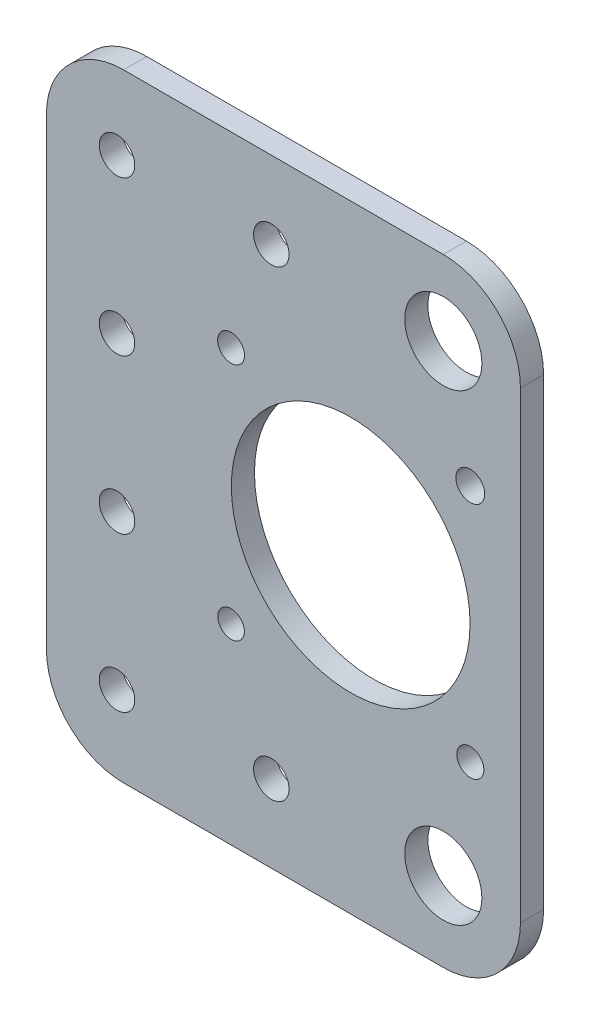
ISO-10303-21;
HEADER;
FILE_DESCRIPTION(('STEP AP214'),'2;1');
FILE_NAME('part.step','',(''),(''),'','','');
FILE_SCHEMA(('AUTOMOTIVE_DESIGN { 1 0 10303 214 1 1 1 1 }'));
ENDSEC;
DATA;
#1=APPLICATION_CONTEXT('core data for automotive mechanical design processes');
#2=APPLICATION_PROTOCOL_DEFINITION('international standard','automotive_design',2000,#1);
#3=PRODUCT_CONTEXT('',#1,'mechanical');
#4=PRODUCT('Part','Part','',(#3));
#5=PRODUCT_RELATED_PRODUCT_CATEGORY('part','',(#4));
#6=PRODUCT_DEFINITION_FORMATION('','',#4);
#7=PRODUCT_DEFINITION_CONTEXT('part definition',#1,'design');
#8=PRODUCT_DEFINITION('design','',#6,#7);
#9=PRODUCT_DEFINITION_SHAPE('','',#8);
#10=(LENGTH_UNIT() NAMED_UNIT(*) SI_UNIT(.MILLI.,.METRE.));
#11=(NAMED_UNIT(*) PLANE_ANGLE_UNIT() SI_UNIT($,.RADIAN.));
#12=(NAMED_UNIT(*) SI_UNIT($,.STERADIAN.) SOLID_ANGLE_UNIT());
#13=UNCERTAINTY_MEASURE_WITH_UNIT(LENGTH_MEASURE(1.E-05),#10,'distance_accuracy_value','');
#14=(GEOMETRIC_REPRESENTATION_CONTEXT(3) GLOBAL_UNCERTAINTY_ASSIGNED_CONTEXT((#13)) GLOBAL_UNIT_ASSIGNED_CONTEXT((#10,
#11,#12)) REPRESENTATION_CONTEXT('',''));
#15=CARTESIAN_POINT('',(0.,0.,0.));
#16=DIRECTION('',(0.,0.,1.));
#17=DIRECTION('',(1.,0.,0.));
#18=AXIS2_PLACEMENT_3D('',#15,#16,#17);
#19=CARTESIAN_POINT('',(157.960700719284,-141.896756478859,3.));
#20=DIRECTION('',(0.,0.,1.));
#21=DIRECTION('',(1.,0.,0.));
#22=AXIS2_PLACEMENT_3D('',#19,#20,#21);
#23=PLANE('',#22);
#24=CARTESIAN_POINT('',(157.960700719284,-141.591712302338,3.));
#25=DIRECTION('',(0.,0.,1.));
#26=DIRECTION('',(1.,0.,0.));
#27=AXIS2_PLACEMENT_3D('',#24,#25,#26);
#28=CIRCLE('',#27,4.99999999999999);
#29=CARTESIAN_POINT('',(162.960700719284,-141.591712302338,3.));
#30=VERTEX_POINT('',#29);
#31=EDGE_CURVE('E242',#30,#30,#28,.T.);
#32=ORIENTED_EDGE('',*,*,#31,.F.);
#33=EDGE_LOOP('',(#32));
#34=FACE_BOUND('',#33,.T.);
#35=CARTESIAN_POINT('',(161.460700719284,-127.091712302338,3.));
#36=DIRECTION('',(0.,0.,1.));
#37=DIRECTION('',(1.,0.,0.));
#38=AXIS2_PLACEMENT_3D('',#35,#36,#37);
#39=CIRCLE('',#38,1.75420597389953);
#40=CARTESIAN_POINT('',(163.214906693183,-127.091712302338,3.));
#41=VERTEX_POINT('',#40);
#42=EDGE_CURVE('E230',#41,#41,#39,.T.);
#43=ORIENTED_EDGE('',*,*,#42,.F.);
#44=EDGE_LOOP('',(#43));
#45=FACE_BOUND('',#44,.T.);
#46=CARTESIAN_POINT('',(161.460700719284,-96.0917123023381,3.));
#47=DIRECTION('',(0.,0.,1.));
#48=DIRECTION('',(1.,0.,0.));
#49=AXIS2_PLACEMENT_3D('',#46,#47,#48);
#50=CIRCLE('',#49,1.87320006257759);
#51=CARTESIAN_POINT('',(163.333900781861,-96.0917123023381,3.));
#52=VERTEX_POINT('',#51);
#53=EDGE_CURVE('E218',#52,#52,#50,.T.);
#54=ORIENTED_EDGE('',*,*,#53,.F.);
#55=EDGE_LOOP('',(#54));
#56=FACE_BOUND('',#55,.T.);
#57=CARTESIAN_POINT('',(115.674612815836,-141.866196007986,3.));
#58=DIRECTION('',(0.,0.,1.));
#59=DIRECTION('',(1.,0.,0.));
#60=AXIS2_PLACEMENT_3D('',#57,#58,#59);
#61=CIRCLE('',#60,2.30000000000001);
#62=CARTESIAN_POINT('',(117.974612815836,-141.866196007986,3.));
#63=VERTEX_POINT('',#62);
#64=EDGE_CURVE('E206',#63,#63,#61,.T.);
#65=ORIENTED_EDGE('',*,*,#64,.F.);
#66=EDGE_LOOP('',(#65));
#67=FACE_BOUND('',#66,.T.);
#68=CARTESIAN_POINT('',(135.674612815836,-81.8661960079857,3.));
#69=DIRECTION('',(0.,0.,1.));
#70=DIRECTION('',(1.,0.,0.));
#71=AXIS2_PLACEMENT_3D('',#68,#69,#70);
#72=CIRCLE('',#71,2.30000000000001);
#73=CARTESIAN_POINT('',(137.974612815836,-81.8661960079857,3.));
#74=VERTEX_POINT('',#73);
#75=EDGE_CURVE('E194',#74,#74,#72,.T.);
#76=ORIENTED_EDGE('',*,*,#75,.F.);
#77=EDGE_LOOP('',(#76));
#78=FACE_BOUND('',#77,.T.);
#79=CARTESIAN_POINT('',(115.674612815836,-121.866196007986,3.));
#80=DIRECTION('',(0.,0.,1.));
#81=DIRECTION('',(1.,0.,0.));
#82=AXIS2_PLACEMENT_3D('',#79,#80,#81);
#83=CIRCLE('',#82,2.30000000000001);
#84=CARTESIAN_POINT('',(117.974612815836,-121.866196007986,3.));
#85=VERTEX_POINT('',#84);
#86=EDGE_CURVE('E182',#85,#85,#83,.T.);
#87=ORIENTED_EDGE('',*,*,#86,.F.);
#88=EDGE_LOOP('',(#87));
#89=FACE_BOUND('',#88,.T.);
#90=CARTESIAN_POINT('',(157.960700719284,-141.896756478859,3.));
#91=DIRECTION('',(0.,0.,1.));
#92=DIRECTION('',(1.,0.,0.));
#93=AXIS2_PLACEMENT_3D('',#90,#91,#92);
#94=CIRCLE('',#93,9.99999999999999);
#95=CARTESIAN_POINT('',(157.960700719284,-151.896756478859,3.));
#96=VERTEX_POINT('',#95);
#97=CARTESIAN_POINT('',(167.960700719284,-141.896756478859,3.));
#98=VERTEX_POINT('',#97);
#99=EDGE_CURVE('E145',#96,#98,#94,.T.);
#100=ORIENTED_EDGE('',*,*,#99,.T.);
#101=DIRECTION('',(0.,1.,0.));
#102=VECTOR('',#101,1.);
#103=CARTESIAN_POINT('',(167.960700719284,-81.8661960079857,3.));
#104=LINE('',#103,#102);
#105=CARTESIAN_POINT('',(167.960700719284,-81.8661960079857,3.));
#106=VERTEX_POINT('',#105);
#107=EDGE_CURVE('E93',#98,#106,#104,.T.);
#108=ORIENTED_EDGE('',*,*,#107,.T.);
#109=CARTESIAN_POINT('',(157.960700719284,-81.8661960079857,3.));
#110=DIRECTION('',(0.,0.,1.));
#111=DIRECTION('',(-1.,0.,0.));
#112=AXIS2_PLACEMENT_3D('',#109,#110,#111);
#113=CIRCLE('',#112,10.);
#114=CARTESIAN_POINT('',(157.960700719284,-71.8661960079857,3.));
#115=VERTEX_POINT('',#114);
#116=EDGE_CURVE('E160',#106,#115,#113,.T.);
#117=ORIENTED_EDGE('',*,*,#116,.T.);
#118=DIRECTION('',(-1.,0.,0.));
#119=VECTOR('',#118,1.);
#120=CARTESIAN_POINT('',(116.52582366594,-71.8661960079857,3.));
#121=LINE('',#120,#119);
#122=CARTESIAN_POINT('',(116.52582366594,-71.8661960079857,3.));
#123=VERTEX_POINT('',#122);
#124=EDGE_CURVE('E173',#115,#123,#121,.T.);
#125=ORIENTED_EDGE('',*,*,#124,.T.);
#126=CARTESIAN_POINT('',(116.52582366594,-81.8661960079857,3.));
#127=DIRECTION('',(0.,0.,1.));
#128=DIRECTION('',(1.,0.,0.));
#129=AXIS2_PLACEMENT_3D('',#126,#127,#128);
#130=CIRCLE('',#129,9.99999999999999);
#131=CARTESIAN_POINT('',(106.52582366594,-81.8661960079857,3.));
#132=VERTEX_POINT('',#131);
#133=EDGE_CURVE('E112',#123,#132,#130,.T.);
#134=ORIENTED_EDGE('',*,*,#133,.T.);
#135=DIRECTION('',(0.,-1.,0.));
#136=VECTOR('',#135,1.);
#137=CARTESIAN_POINT('',(106.52582366594,-81.8661960079857,3.));
#138=LINE('',#137,#136);
#139=CARTESIAN_POINT('',(106.52582366594,-141.896756478859,3.));
#140=VERTEX_POINT('',#139);
#141=EDGE_CURVE('E106',#132,#140,#138,.T.);
#142=ORIENTED_EDGE('',*,*,#141,.T.);
#143=CARTESIAN_POINT('',(116.52582366594,-141.896756478859,3.));
#144=DIRECTION('',(0.,0.,1.));
#145=DIRECTION('',(1.,0.,0.));
#146=AXIS2_PLACEMENT_3D('',#143,#144,#145);
#147=CIRCLE('',#146,9.99999999999999);
#148=CARTESIAN_POINT('',(116.52582366594,-151.896756478859,3.));
#149=VERTEX_POINT('',#148);
#150=EDGE_CURVE('E110',#140,#149,#147,.T.);
#151=ORIENTED_EDGE('',*,*,#150,.T.);
#152=DIRECTION('',(1.,0.,0.));
#153=VECTOR('',#152,1.);
#154=CARTESIAN_POINT('',(116.52582366594,-151.896756478859,3.));
#155=LINE('',#154,#153);
#156=EDGE_CURVE('E50',#149,#96,#155,.T.);
#157=ORIENTED_EDGE('',*,*,#156,.T.);
#158=EDGE_LOOP('',(#100,#108,#117,#125,#134,#142,#151,#157));
#159=FACE_BOUND('',#158,.T.);
#160=CARTESIAN_POINT('',(115.674612815836,-101.866196007986,3.));
#161=DIRECTION('',(0.,0.,1.));
#162=DIRECTION('',(1.,0.,0.));
#163=AXIS2_PLACEMENT_3D('',#160,#161,#162);
#164=CIRCLE('',#163,2.29999999999999);
#165=CARTESIAN_POINT('',(117.974612815836,-101.866196007986,3.));
#166=VERTEX_POINT('',#165);
#167=EDGE_CURVE('E134',#166,#166,#164,.T.);
#168=ORIENTED_EDGE('',*,*,#167,.F.);
#169=EDGE_LOOP('',(#168));
#170=FACE_BOUND('',#169,.T.);
#171=CARTESIAN_POINT('',(135.674612815836,-141.866196007986,3.));
#172=DIRECTION('',(0.,0.,1.));
#173=DIRECTION('',(1.,0.,0.));
#174=AXIS2_PLACEMENT_3D('',#171,#172,#173);
#175=CIRCLE('',#174,2.30000000000001);
#176=CARTESIAN_POINT('',(137.974612815836,-141.866196007986,3.));
#177=VERTEX_POINT('',#176);
#178=EDGE_CURVE('E188',#177,#177,#175,.T.);
#179=ORIENTED_EDGE('',*,*,#178,.F.);
#180=EDGE_LOOP('',(#179));
#181=FACE_BOUND('',#180,.T.);
#182=CARTESIAN_POINT('',(115.674612815836,-81.8661960079857,3.));
#183=DIRECTION('',(0.,0.,1.));
#184=DIRECTION('',(1.,0.,0.));
#185=AXIS2_PLACEMENT_3D('',#182,#183,#184);
#186=CIRCLE('',#185,2.29999999999999);
#187=CARTESIAN_POINT('',(117.974612815836,-81.8661960079857,3.));
#188=VERTEX_POINT('',#187);
#189=EDGE_CURVE('E200',#188,#188,#186,.T.);
#190=ORIENTED_EDGE('',*,*,#189,.F.);
#191=EDGE_LOOP('',(#190));
#192=FACE_BOUND('',#191,.T.);
#193=CARTESIAN_POINT('',(130.460700719284,-96.0917123023381,3.));
#194=DIRECTION('',(0.,0.,1.));
#195=DIRECTION('',(1.,0.,0.));
#196=AXIS2_PLACEMENT_3D('',#193,#194,#195);
#197=CIRCLE('',#196,1.73788566181092);
#198=CARTESIAN_POINT('',(132.198586381095,-96.0917123023381,3.));
#199=VERTEX_POINT('',#198);
#200=EDGE_CURVE('E212',#199,#199,#197,.T.);
#201=ORIENTED_EDGE('',*,*,#200,.F.);
#202=EDGE_LOOP('',(#201));
#203=FACE_BOUND('',#202,.T.);
#204=CARTESIAN_POINT('',(130.460700719284,-127.091712302338,3.));
#205=DIRECTION('',(0.,0.,1.));
#206=DIRECTION('',(1.,0.,0.));
#207=AXIS2_PLACEMENT_3D('',#204,#205,#206);
#208=CIRCLE('',#207,1.72227871828202);
#209=CARTESIAN_POINT('',(132.182979437566,-127.091712302338,3.));
#210=VERTEX_POINT('',#209);
#211=EDGE_CURVE('E224',#210,#210,#208,.T.);
#212=ORIENTED_EDGE('',*,*,#211,.F.);
#213=EDGE_LOOP('',(#212));
#214=FACE_BOUND('',#213,.T.);
#215=CARTESIAN_POINT('',(145.960700719284,-111.591712302338,3.));
#216=DIRECTION('',(0.,0.,1.));
#217=DIRECTION('',(1.,0.,0.));
#218=AXIS2_PLACEMENT_3D('',#215,#216,#217);
#219=CIRCLE('',#218,15.469551166184);
#220=CARTESIAN_POINT('',(161.430251885468,-111.591712302338,3.));
#221=VERTEX_POINT('',#220);
#222=EDGE_CURVE('E236',#221,#221,#219,.T.);
#223=ORIENTED_EDGE('',*,*,#222,.F.);
#224=EDGE_LOOP('',(#223));
#225=FACE_BOUND('',#224,.T.);
#226=CARTESIAN_POINT('',(157.960700719284,-81.5917123023381,3.));
#227=DIRECTION('',(0.,0.,1.));
#228=DIRECTION('',(1.,0.,0.));
#229=AXIS2_PLACEMENT_3D('',#226,#227,#228);
#230=CIRCLE('',#229,5.00000000000002);
#231=CARTESIAN_POINT('',(162.960700719284,-81.5917123023381,3.));
#232=VERTEX_POINT('',#231);
#233=EDGE_CURVE('E248',#232,#232,#230,.T.);
#234=ORIENTED_EDGE('',*,*,#233,.F.);
#235=EDGE_LOOP('',(#234));
#236=FACE_BOUND('',#235,.T.);
#237=ADVANCED_FACE('F33',(#34,#45,#56,#67,#78,#89,#159,#170,#181,#192,#203,#214,#225,#236),#23,.T.);
#238=CARTESIAN_POINT('',(157.960700719284,-141.896756478859,0.));
#239=DIRECTION('',(0.,0.,1.));
#240=DIRECTION('',(1.,0.,0.));
#241=AXIS2_PLACEMENT_3D('',#238,#239,#240);
#242=PLANE('',#241);
#243=CARTESIAN_POINT('',(157.960700719284,-141.896756478859,0.));
#244=DIRECTION('',(0.,0.,1.));
#245=DIRECTION('',(1.,0.,0.));
#246=AXIS2_PLACEMENT_3D('',#243,#244,#245);
#247=CIRCLE('',#246,9.99999999999999);
#248=CARTESIAN_POINT('',(157.960700719284,-151.896756478859,0.));
#249=VERTEX_POINT('',#248);
#250=CARTESIAN_POINT('',(167.960700719284,-141.896756478859,0.));
#251=VERTEX_POINT('',#250);
#252=EDGE_CURVE('E130',#249,#251,#247,.T.);
#253=ORIENTED_EDGE('',*,*,#252,.F.);
#254=DIRECTION('',(1.,0.,0.));
#255=VECTOR('',#254,1.);
#256=CARTESIAN_POINT('',(116.52582366594,-151.896756478859,0.));
#257=LINE('',#256,#255);
#258=CARTESIAN_POINT('',(116.52582366594,-151.896756478859,0.));
#259=VERTEX_POINT('',#258);
#260=EDGE_CURVE('E85',#259,#249,#257,.T.);
#261=ORIENTED_EDGE('',*,*,#260,.F.);
#262=CARTESIAN_POINT('',(116.52582366594,-141.896756478859,0.));
#263=DIRECTION('',(0.,0.,1.));
#264=DIRECTION('',(1.,0.,0.));
#265=AXIS2_PLACEMENT_3D('',#262,#263,#264);
#266=CIRCLE('',#265,9.99999999999999);
#267=CARTESIAN_POINT('',(106.52582366594,-141.896756478859,0.));
#268=VERTEX_POINT('',#267);
#269=EDGE_CURVE('E79',#268,#259,#266,.T.);
#270=ORIENTED_EDGE('',*,*,#269,.F.);
#271=DIRECTION('',(0.,-1.,0.));
#272=VECTOR('',#271,1.);
#273=CARTESIAN_POINT('',(106.52582366594,-81.8661960079857,0.));
#274=LINE('',#273,#272);
#275=CARTESIAN_POINT('',(106.52582366594,-81.8661960079857,0.));
#276=VERTEX_POINT('',#275);
#277=EDGE_CURVE('E120',#276,#268,#274,.T.);
#278=ORIENTED_EDGE('',*,*,#277,.F.);
#279=CARTESIAN_POINT('',(116.52582366594,-81.8661960079857,0.));
#280=DIRECTION('',(0.,0.,1.));
#281=DIRECTION('',(1.,0.,0.));
#282=AXIS2_PLACEMENT_3D('',#279,#280,#281);
#283=CIRCLE('',#282,9.99999999999999);
#284=CARTESIAN_POINT('',(116.52582366594,-71.8661960079857,0.));
#285=VERTEX_POINT('',#284);
#286=EDGE_CURVE('E140',#285,#276,#283,.T.);
#287=ORIENTED_EDGE('',*,*,#286,.F.);
#288=DIRECTION('',(-1.,0.,0.));
#289=VECTOR('',#288,1.);
#290=CARTESIAN_POINT('',(116.52582366594,-71.8661960079857,0.));
#291=LINE('',#290,#289);
#292=CARTESIAN_POINT('',(157.960700719284,-71.8661960079857,0.));
#293=VERTEX_POINT('',#292);
#294=EDGE_CURVE('E138',#293,#285,#291,.T.);
#295=ORIENTED_EDGE('',*,*,#294,.F.);
#296=CARTESIAN_POINT('',(157.960700719284,-81.8661960079857,0.));
#297=DIRECTION('',(0.,0.,1.));
#298=DIRECTION('',(-1.,0.,0.));
#299=AXIS2_PLACEMENT_3D('',#296,#297,#298);
#300=CIRCLE('',#299,10.);
#301=CARTESIAN_POINT('',(167.960700719284,-81.8661960079857,0.));
#302=VERTEX_POINT('',#301);
#303=EDGE_CURVE('E136',#302,#293,#300,.T.);
#304=ORIENTED_EDGE('',*,*,#303,.F.);
#305=DIRECTION('',(0.,1.,0.));
#306=VECTOR('',#305,1.);
#307=CARTESIAN_POINT('',(167.960700719284,-81.8661960079857,0.));
#308=LINE('',#307,#306);
#309=EDGE_CURVE('E133',#251,#302,#308,.T.);
#310=ORIENTED_EDGE('',*,*,#309,.F.);
#311=EDGE_LOOP('',(#253,#261,#270,#278,#287,#295,#304,#310));
#312=FACE_BOUND('',#311,.T.);
#313=CARTESIAN_POINT('',(115.674612815836,-101.866196007986,0.));
#314=DIRECTION('',(0.,0.,1.));
#315=DIRECTION('',(1.,0.,0.));
#316=AXIS2_PLACEMENT_3D('',#313,#314,#315);
#317=CIRCLE('',#316,2.29999999999999);
#318=CARTESIAN_POINT('',(117.974612815836,-101.866196007986,0.));
#319=VERTEX_POINT('',#318);
#320=EDGE_CURVE('E179',#319,#319,#317,.T.);
#321=ORIENTED_EDGE('',*,*,#320,.T.);
#322=EDGE_LOOP('',(#321));
#323=FACE_BOUND('',#322,.T.);
#324=CARTESIAN_POINT('',(115.674612815836,-121.866196007986,0.));
#325=DIRECTION('',(0.,0.,1.));
#326=DIRECTION('',(1.,0.,0.));
#327=AXIS2_PLACEMENT_3D('',#324,#325,#326);
#328=CIRCLE('',#327,2.30000000000001);
#329=CARTESIAN_POINT('',(117.974612815836,-121.866196007986,0.));
#330=VERTEX_POINT('',#329);
#331=EDGE_CURVE('E185',#330,#330,#328,.T.);
#332=ORIENTED_EDGE('',*,*,#331,.T.);
#333=EDGE_LOOP('',(#332));
#334=FACE_BOUND('',#333,.T.);
#335=CARTESIAN_POINT('',(135.674612815836,-141.866196007986,0.));
#336=DIRECTION('',(0.,0.,1.));
#337=DIRECTION('',(1.,0.,0.));
#338=AXIS2_PLACEMENT_3D('',#335,#336,#337);
#339=CIRCLE('',#338,2.30000000000001);
#340=CARTESIAN_POINT('',(137.974612815836,-141.866196007986,0.));
#341=VERTEX_POINT('',#340);
#342=EDGE_CURVE('E191',#341,#341,#339,.T.);
#343=ORIENTED_EDGE('',*,*,#342,.T.);
#344=EDGE_LOOP('',(#343));
#345=FACE_BOUND('',#344,.T.);
#346=CARTESIAN_POINT('',(135.674612815836,-81.8661960079857,0.));
#347=DIRECTION('',(0.,0.,1.));
#348=DIRECTION('',(1.,0.,0.));
#349=AXIS2_PLACEMENT_3D('',#346,#347,#348);
#350=CIRCLE('',#349,2.30000000000001);
#351=CARTESIAN_POINT('',(137.974612815836,-81.8661960079857,0.));
#352=VERTEX_POINT('',#351);
#353=EDGE_CURVE('E197',#352,#352,#350,.T.);
#354=ORIENTED_EDGE('',*,*,#353,.T.);
#355=EDGE_LOOP('',(#354));
#356=FACE_BOUND('',#355,.T.);
#357=CARTESIAN_POINT('',(115.674612815836,-81.8661960079857,0.));
#358=DIRECTION('',(0.,0.,1.));
#359=DIRECTION('',(1.,0.,0.));
#360=AXIS2_PLACEMENT_3D('',#357,#358,#359);
#361=CIRCLE('',#360,2.29999999999999);
#362=CARTESIAN_POINT('',(117.974612815836,-81.8661960079857,0.));
#363=VERTEX_POINT('',#362);
#364=EDGE_CURVE('E203',#363,#363,#361,.T.);
#365=ORIENTED_EDGE('',*,*,#364,.T.);
#366=EDGE_LOOP('',(#365));
#367=FACE_BOUND('',#366,.T.);
#368=CARTESIAN_POINT('',(115.674612815836,-141.866196007986,0.));
#369=DIRECTION('',(0.,0.,1.));
#370=DIRECTION('',(1.,0.,0.));
#371=AXIS2_PLACEMENT_3D('',#368,#369,#370);
#372=CIRCLE('',#371,2.30000000000001);
#373=CARTESIAN_POINT('',(117.974612815836,-141.866196007986,0.));
#374=VERTEX_POINT('',#373);
#375=EDGE_CURVE('E209',#374,#374,#372,.T.);
#376=ORIENTED_EDGE('',*,*,#375,.T.);
#377=EDGE_LOOP('',(#376));
#378=FACE_BOUND('',#377,.T.);
#379=CARTESIAN_POINT('',(130.460700719284,-96.0917123023381,0.));
#380=DIRECTION('',(0.,0.,1.));
#381=DIRECTION('',(1.,0.,0.));
#382=AXIS2_PLACEMENT_3D('',#379,#380,#381);
#383=CIRCLE('',#382,1.73788566181092);
#384=CARTESIAN_POINT('',(132.198586381095,-96.0917123023381,0.));
#385=VERTEX_POINT('',#384);
#386=EDGE_CURVE('E215',#385,#385,#383,.T.);
#387=ORIENTED_EDGE('',*,*,#386,.T.);
#388=EDGE_LOOP('',(#387));
#389=FACE_BOUND('',#388,.T.);
#390=CARTESIAN_POINT('',(161.460700719284,-96.0917123023381,0.));
#391=DIRECTION('',(0.,0.,1.));
#392=DIRECTION('',(1.,0.,0.));
#393=AXIS2_PLACEMENT_3D('',#390,#391,#392);
#394=CIRCLE('',#393,1.87320006257759);
#395=CARTESIAN_POINT('',(163.333900781861,-96.0917123023381,0.));
#396=VERTEX_POINT('',#395);
#397=EDGE_CURVE('E221',#396,#396,#394,.T.);
#398=ORIENTED_EDGE('',*,*,#397,.T.);
#399=EDGE_LOOP('',(#398));
#400=FACE_BOUND('',#399,.T.);
#401=CARTESIAN_POINT('',(130.460700719284,-127.091712302338,0.));
#402=DIRECTION('',(0.,0.,1.));
#403=DIRECTION('',(1.,0.,0.));
#404=AXIS2_PLACEMENT_3D('',#401,#402,#403);
#405=CIRCLE('',#404,1.72227871828202);
#406=CARTESIAN_POINT('',(132.182979437566,-127.091712302338,0.));
#407=VERTEX_POINT('',#406);
#408=EDGE_CURVE('E227',#407,#407,#405,.T.);
#409=ORIENTED_EDGE('',*,*,#408,.T.);
#410=EDGE_LOOP('',(#409));
#411=FACE_BOUND('',#410,.T.);
#412=CARTESIAN_POINT('',(161.460700719284,-127.091712302338,0.));
#413=DIRECTION('',(0.,0.,1.));
#414=DIRECTION('',(1.,0.,0.));
#415=AXIS2_PLACEMENT_3D('',#412,#413,#414);
#416=CIRCLE('',#415,1.75420597389953);
#417=CARTESIAN_POINT('',(163.214906693183,-127.091712302338,0.));
#418=VERTEX_POINT('',#417);
#419=EDGE_CURVE('E233',#418,#418,#416,.T.);
#420=ORIENTED_EDGE('',*,*,#419,.T.);
#421=EDGE_LOOP('',(#420));
#422=FACE_BOUND('',#421,.T.);
#423=CARTESIAN_POINT('',(145.960700719284,-111.591712302338,0.));
#424=DIRECTION('',(0.,0.,1.));
#425=DIRECTION('',(1.,0.,0.));
#426=AXIS2_PLACEMENT_3D('',#423,#424,#425);
#427=CIRCLE('',#426,15.469551166184);
#428=CARTESIAN_POINT('',(161.430251885468,-111.591712302338,0.));
#429=VERTEX_POINT('',#428);
#430=EDGE_CURVE('E239',#429,#429,#427,.T.);
#431=ORIENTED_EDGE('',*,*,#430,.T.);
#432=EDGE_LOOP('',(#431));
#433=FACE_BOUND('',#432,.T.);
#434=CARTESIAN_POINT('',(157.960700719284,-141.591712302338,0.));
#435=DIRECTION('',(0.,0.,1.));
#436=DIRECTION('',(1.,0.,0.));
#437=AXIS2_PLACEMENT_3D('',#434,#435,#436);
#438=CIRCLE('',#437,4.99999999999999);
#439=CARTESIAN_POINT('',(162.960700719284,-141.591712302338,0.));
#440=VERTEX_POINT('',#439);
#441=EDGE_CURVE('E245',#440,#440,#438,.T.);
#442=ORIENTED_EDGE('',*,*,#441,.T.);
#443=EDGE_LOOP('',(#442));
#444=FACE_BOUND('',#443,.T.);
#445=CARTESIAN_POINT('',(157.960700719284,-81.5917123023381,0.));
#446=DIRECTION('',(0.,0.,1.));
#447=DIRECTION('',(1.,0.,0.));
#448=AXIS2_PLACEMENT_3D('',#445,#446,#447);
#449=CIRCLE('',#448,5.00000000000002);
#450=CARTESIAN_POINT('',(162.960700719284,-81.5917123023381,0.));
#451=VERTEX_POINT('',#450);
#452=EDGE_CURVE('E251',#451,#451,#449,.T.);
#453=ORIENTED_EDGE('',*,*,#452,.T.);
#454=EDGE_LOOP('',(#453));
#455=FACE_BOUND('',#454,.T.);
#456=ADVANCED_FACE('F164',(#312,#323,#334,#345,#356,#367,#378,#389,#400,#411,#422,#433,#444,
#455),#242,.F.);
#457=CARTESIAN_POINT('',(157.960700719284,-141.896756478859,3.));
#458=DIRECTION('',(0.,0.,-1.));
#459=DIRECTION('',(-1.,0.,0.));
#460=AXIS2_PLACEMENT_3D('',#457,#458,#459);
#461=CYLINDRICAL_SURFACE('',#460,9.99999999999999);
#462=ORIENTED_EDGE('',*,*,#252,.T.);
#463=DIRECTION('',(0.,0.,-1.));
#464=VECTOR('',#463,1.);
#465=CARTESIAN_POINT('',(167.960700719284,-141.896756478859,3.));
#466=LINE('',#465,#464);
#467=EDGE_CURVE('E11',#98,#251,#466,.T.);
#468=ORIENTED_EDGE('',*,*,#467,.F.);
#469=ORIENTED_EDGE('',*,*,#99,.F.);
#470=DIRECTION('',(0.,0.,-1.));
#471=VECTOR('',#470,1.);
#472=CARTESIAN_POINT('',(157.960700719284,-151.896756478859,3.));
#473=LINE('',#472,#471);
#474=EDGE_CURVE('E126',#96,#249,#473,.T.);
#475=ORIENTED_EDGE('',*,*,#474,.T.);
#476=EDGE_LOOP('',(#462,#468,#469,#475));
#477=FACE_BOUND('',#476,.T.);
#478=ADVANCED_FACE('F35',(#477),#461,.T.);
#479=CARTESIAN_POINT('',(167.960700719284,-81.8661960079857,3.));
#480=DIRECTION('',(-1.,0.,0.));
#481=DIRECTION('',(0.,-1.,0.));
#482=AXIS2_PLACEMENT_3D('',#479,#480,#481);
#483=PLANE('',#482);
#484=ORIENTED_EDGE('',*,*,#309,.T.);
#485=DIRECTION('',(0.,0.,-1.));
#486=VECTOR('',#485,1.);
#487=CARTESIAN_POINT('',(167.960700719284,-81.8661960079857,3.));
#488=LINE('',#487,#486);
#489=EDGE_CURVE('E42',#106,#302,#488,.T.);
#490=ORIENTED_EDGE('',*,*,#489,.F.);
#491=ORIENTED_EDGE('',*,*,#107,.F.);
#492=ORIENTED_EDGE('',*,*,#467,.T.);
#493=EDGE_LOOP('',(#484,#490,#491,#492));
#494=FACE_BOUND('',#493,.T.);
#495=ADVANCED_FACE('F285',(#494),#483,.F.);
#496=CARTESIAN_POINT('',(157.960700719284,-81.8661960079857,3.));
#497=DIRECTION('',(0.,0.,-1.));
#498=DIRECTION('',(-1.,0.,0.));
#499=AXIS2_PLACEMENT_3D('',#496,#497,#498);
#500=CYLINDRICAL_SURFACE('',#499,10.);
#501=ORIENTED_EDGE('',*,*,#303,.T.);
#502=DIRECTION('',(0.,0.,-1.));
#503=VECTOR('',#502,1.);
#504=CARTESIAN_POINT('',(157.960700719284,-71.8661960079857,3.));
#505=LINE('',#504,#503);
#506=EDGE_CURVE('E152',#115,#293,#505,.T.);
#507=ORIENTED_EDGE('',*,*,#506,.F.);
#508=ORIENTED_EDGE('',*,*,#116,.F.);
#509=ORIENTED_EDGE('',*,*,#489,.T.);
#510=EDGE_LOOP('',(#501,#507,#508,#509));
#511=FACE_BOUND('',#510,.T.);
#512=ADVANCED_FACE('F158',(#511),#500,.T.);
#513=CARTESIAN_POINT('',(116.52582366594,-71.8661960079857,3.));
#514=DIRECTION('',(0.,-1.,0.));
#515=DIRECTION('',(0.,0.,-1.));
#516=AXIS2_PLACEMENT_3D('',#513,#514,#515);
#517=PLANE('',#516);
#518=ORIENTED_EDGE('',*,*,#294,.T.);
#519=DIRECTION('',(0.,0.,-1.));
#520=VECTOR('',#519,1.);
#521=CARTESIAN_POINT('',(116.52582366594,-71.8661960079857,3.));
#522=LINE('',#521,#520);
#523=EDGE_CURVE('E149',#123,#285,#522,.T.);
#524=ORIENTED_EDGE('',*,*,#523,.F.);
#525=ORIENTED_EDGE('',*,*,#124,.F.);
#526=ORIENTED_EDGE('',*,*,#506,.T.);
#527=EDGE_LOOP('',(#518,#524,#525,#526));
#528=FACE_BOUND('',#527,.T.);
#529=ADVANCED_FACE('F169',(#528),#517,.F.);
#530=CARTESIAN_POINT('',(116.52582366594,-81.8661960079857,3.));
#531=DIRECTION('',(0.,0.,-1.));
#532=DIRECTION('',(-1.,0.,0.));
#533=AXIS2_PLACEMENT_3D('',#530,#531,#532);
#534=CYLINDRICAL_SURFACE('',#533,9.99999999999999);
#535=ORIENTED_EDGE('',*,*,#286,.T.);
#536=DIRECTION('',(0.,0.,-1.));
#537=VECTOR('',#536,1.);
#538=CARTESIAN_POINT('',(106.52582366594,-81.8661960079857,3.));
#539=LINE('',#538,#537);
#540=EDGE_CURVE('E121',#132,#276,#539,.T.);
#541=ORIENTED_EDGE('',*,*,#540,.F.);
#542=ORIENTED_EDGE('',*,*,#133,.F.);
#543=ORIENTED_EDGE('',*,*,#523,.T.);
#544=EDGE_LOOP('',(#535,#541,#542,#543));
#545=FACE_BOUND('',#544,.T.);
#546=ADVANCED_FACE('F172',(#545),#534,.T.);
#547=CARTESIAN_POINT('',(106.52582366594,-81.8661960079857,3.));
#548=DIRECTION('',(1.,0.,0.));
#549=DIRECTION('',(0.,1.,0.));
#550=AXIS2_PLACEMENT_3D('',#547,#548,#549);
#551=PLANE('',#550);
#552=ORIENTED_EDGE('',*,*,#277,.T.);
#553=DIRECTION('',(0.,0.,-1.));
#554=VECTOR('',#553,1.);
#555=CARTESIAN_POINT('',(106.52582366594,-141.896756478859,3.));
#556=LINE('',#555,#554);
#557=EDGE_CURVE('E117',#140,#268,#556,.T.);
#558=ORIENTED_EDGE('',*,*,#557,.F.);
#559=ORIENTED_EDGE('',*,*,#141,.F.);
#560=ORIENTED_EDGE('',*,*,#540,.T.);
#561=EDGE_LOOP('',(#552,#558,#559,#560));
#562=FACE_BOUND('',#561,.T.);
#563=ADVANCED_FACE('F118',(#562),#551,.F.);
#564=CARTESIAN_POINT('',(116.52582366594,-141.896756478859,3.));
#565=DIRECTION('',(0.,0.,-1.));
#566=DIRECTION('',(-1.,0.,0.));
#567=AXIS2_PLACEMENT_3D('',#564,#565,#566);
#568=CYLINDRICAL_SURFACE('',#567,9.99999999999999);
#569=ORIENTED_EDGE('',*,*,#269,.T.);
#570=DIRECTION('',(0.,0.,-1.));
#571=VECTOR('',#570,1.);
#572=CARTESIAN_POINT('',(116.52582366594,-151.896756478859,3.));
#573=LINE('',#572,#571);
#574=EDGE_CURVE('E122',#149,#259,#573,.T.);
#575=ORIENTED_EDGE('',*,*,#574,.F.);
#576=ORIENTED_EDGE('',*,*,#150,.F.);
#577=ORIENTED_EDGE('',*,*,#557,.T.);
#578=EDGE_LOOP('',(#569,#575,#576,#577));
#579=FACE_BOUND('',#578,.T.);
#580=ADVANCED_FACE('F124',(#579),#568,.T.);
#581=CARTESIAN_POINT('',(116.52582366594,-151.896756478859,3.));
#582=DIRECTION('',(0.,1.,0.));
#583=DIRECTION('',(0.,0.,1.));
#584=AXIS2_PLACEMENT_3D('',#581,#582,#583);
#585=PLANE('',#584);
#586=ORIENTED_EDGE('',*,*,#260,.T.);
#587=ORIENTED_EDGE('',*,*,#474,.F.);
#588=ORIENTED_EDGE('',*,*,#156,.F.);
#589=ORIENTED_EDGE('',*,*,#574,.T.);
#590=EDGE_LOOP('',(#586,#587,#588,#589));
#591=FACE_BOUND('',#590,.T.);
#592=ADVANCED_FACE('F273',(#591),#585,.F.);
#593=CARTESIAN_POINT('',(115.674612815836,-101.866196007986,3.));
#594=DIRECTION('',(0.,0.,-1.));
#595=DIRECTION('',(-1.,0.,0.));
#596=AXIS2_PLACEMENT_3D('',#593,#594,#595);
#597=CYLINDRICAL_SURFACE('',#596,2.29999999999999);
#598=ORIENTED_EDGE('',*,*,#167,.T.);
#599=EDGE_LOOP('',(#598));
#600=FACE_BOUND('',#599,.T.);
#601=ORIENTED_EDGE('',*,*,#320,.F.);
#602=EDGE_LOOP('',(#601));
#603=FACE_BOUND('',#602,.T.);
#604=ADVANCED_FACE('F270',(#600,#603),#597,.F.);
#605=CARTESIAN_POINT('',(115.674612815836,-121.866196007986,3.));
#606=DIRECTION('',(0.,0.,-1.));
#607=DIRECTION('',(-1.,0.,0.));
#608=AXIS2_PLACEMENT_3D('',#605,#606,#607);
#609=CYLINDRICAL_SURFACE('',#608,2.30000000000001);
#610=ORIENTED_EDGE('',*,*,#86,.T.);
#611=EDGE_LOOP('',(#610));
#612=FACE_BOUND('',#611,.T.);
#613=ORIENTED_EDGE('',*,*,#331,.F.);
#614=EDGE_LOOP('',(#613));
#615=FACE_BOUND('',#614,.T.);
#616=ADVANCED_FACE('F349',(#612,#615),#609,.F.);
#617=CARTESIAN_POINT('',(135.674612815836,-141.866196007986,3.));
#618=DIRECTION('',(0.,0.,-1.));
#619=DIRECTION('',(-1.,0.,0.));
#620=AXIS2_PLACEMENT_3D('',#617,#618,#619);
#621=CYLINDRICAL_SURFACE('',#620,2.30000000000001);
#622=ORIENTED_EDGE('',*,*,#178,.T.);
#623=EDGE_LOOP('',(#622));
#624=FACE_BOUND('',#623,.T.);
#625=ORIENTED_EDGE('',*,*,#342,.F.);
#626=EDGE_LOOP('',(#625));
#627=FACE_BOUND('',#626,.T.);
#628=ADVANCED_FACE('F357',(#624,#627),#621,.F.);
#629=CARTESIAN_POINT('',(135.674612815836,-81.8661960079857,3.));
#630=DIRECTION('',(0.,0.,-1.));
#631=DIRECTION('',(-1.,0.,0.));
#632=AXIS2_PLACEMENT_3D('',#629,#630,#631);
#633=CYLINDRICAL_SURFACE('',#632,2.30000000000001);
#634=ORIENTED_EDGE('',*,*,#75,.T.);
#635=EDGE_LOOP('',(#634));
#636=FACE_BOUND('',#635,.T.);
#637=ORIENTED_EDGE('',*,*,#353,.F.);
#638=EDGE_LOOP('',(#637));
#639=FACE_BOUND('',#638,.T.);
#640=ADVANCED_FACE('F365',(#636,#639),#633,.F.);
#641=CARTESIAN_POINT('',(115.674612815836,-81.8661960079857,3.));
#642=DIRECTION('',(0.,0.,-1.));
#643=DIRECTION('',(-1.,0.,0.));
#644=AXIS2_PLACEMENT_3D('',#641,#642,#643);
#645=CYLINDRICAL_SURFACE('',#644,2.29999999999999);
#646=ORIENTED_EDGE('',*,*,#189,.T.);
#647=EDGE_LOOP('',(#646));
#648=FACE_BOUND('',#647,.T.);
#649=ORIENTED_EDGE('',*,*,#364,.F.);
#650=EDGE_LOOP('',(#649));
#651=FACE_BOUND('',#650,.T.);
#652=ADVANCED_FACE('F374',(#648,#651),#645,.F.);
#653=CARTESIAN_POINT('',(115.674612815836,-141.866196007986,3.));
#654=DIRECTION('',(0.,0.,-1.));
#655=DIRECTION('',(-1.,0.,0.));
#656=AXIS2_PLACEMENT_3D('',#653,#654,#655);
#657=CYLINDRICAL_SURFACE('',#656,2.30000000000001);
#658=ORIENTED_EDGE('',*,*,#64,.T.);
#659=EDGE_LOOP('',(#658));
#660=FACE_BOUND('',#659,.T.);
#661=ORIENTED_EDGE('',*,*,#375,.F.);
#662=EDGE_LOOP('',(#661));
#663=FACE_BOUND('',#662,.T.);
#664=ADVANCED_FACE('F383',(#660,#663),#657,.F.);
#665=CARTESIAN_POINT('',(130.460700719284,-96.0917123023381,3.));
#666=DIRECTION('',(0.,0.,-1.));
#667=DIRECTION('',(-1.,0.,0.));
#668=AXIS2_PLACEMENT_3D('',#665,#666,#667);
#669=CYLINDRICAL_SURFACE('',#668,1.73788566181092);
#670=ORIENTED_EDGE('',*,*,#200,.T.);
#671=EDGE_LOOP('',(#670));
#672=FACE_BOUND('',#671,.T.);
#673=ORIENTED_EDGE('',*,*,#386,.F.);
#674=EDGE_LOOP('',(#673));
#675=FACE_BOUND('',#674,.T.);
#676=ADVANCED_FACE('F392',(#672,#675),#669,.F.);
#677=CARTESIAN_POINT('',(161.460700719284,-96.0917123023381,3.));
#678=DIRECTION('',(0.,0.,-1.));
#679=DIRECTION('',(-1.,0.,0.));
#680=AXIS2_PLACEMENT_3D('',#677,#678,#679);
#681=CYLINDRICAL_SURFACE('',#680,1.87320006257759);
#682=ORIENTED_EDGE('',*,*,#53,.T.);
#683=EDGE_LOOP('',(#682));
#684=FACE_BOUND('',#683,.T.);
#685=ORIENTED_EDGE('',*,*,#397,.F.);
#686=EDGE_LOOP('',(#685));
#687=FACE_BOUND('',#686,.T.);
#688=ADVANCED_FACE('F401',(#684,#687),#681,.F.);
#689=CARTESIAN_POINT('',(130.460700719284,-127.091712302338,3.));
#690=DIRECTION('',(0.,0.,-1.));
#691=DIRECTION('',(-1.,0.,0.));
#692=AXIS2_PLACEMENT_3D('',#689,#690,#691);
#693=CYLINDRICAL_SURFACE('',#692,1.72227871828202);
#694=ORIENTED_EDGE('',*,*,#211,.T.);
#695=EDGE_LOOP('',(#694));
#696=FACE_BOUND('',#695,.T.);
#697=ORIENTED_EDGE('',*,*,#408,.F.);
#698=EDGE_LOOP('',(#697));
#699=FACE_BOUND('',#698,.T.);
#700=ADVANCED_FACE('F410',(#696,#699),#693,.F.);
#701=CARTESIAN_POINT('',(161.460700719284,-127.091712302338,3.));
#702=DIRECTION('',(0.,0.,-1.));
#703=DIRECTION('',(-1.,0.,0.));
#704=AXIS2_PLACEMENT_3D('',#701,#702,#703);
#705=CYLINDRICAL_SURFACE('',#704,1.75420597389953);
#706=ORIENTED_EDGE('',*,*,#42,.T.);
#707=EDGE_LOOP('',(#706));
#708=FACE_BOUND('',#707,.T.);
#709=ORIENTED_EDGE('',*,*,#419,.F.);
#710=EDGE_LOOP('',(#709));
#711=FACE_BOUND('',#710,.T.);
#712=ADVANCED_FACE('F419',(#708,#711),#705,.F.);
#713=CARTESIAN_POINT('',(145.960700719284,-111.591712302338,3.));
#714=DIRECTION('',(0.,0.,-1.));
#715=DIRECTION('',(-1.,0.,0.));
#716=AXIS2_PLACEMENT_3D('',#713,#714,#715);
#717=CYLINDRICAL_SURFACE('',#716,15.469551166184);
#718=ORIENTED_EDGE('',*,*,#222,.T.);
#719=EDGE_LOOP('',(#718));
#720=FACE_BOUND('',#719,.T.);
#721=ORIENTED_EDGE('',*,*,#430,.F.);
#722=EDGE_LOOP('',(#721));
#723=FACE_BOUND('',#722,.T.);
#724=ADVANCED_FACE('F428',(#720,#723),#717,.F.);
#725=CARTESIAN_POINT('',(157.960700719284,-141.591712302338,3.));
#726=DIRECTION('',(0.,0.,-1.));
#727=DIRECTION('',(-1.,0.,0.));
#728=AXIS2_PLACEMENT_3D('',#725,#726,#727);
#729=CYLINDRICAL_SURFACE('',#728,4.99999999999999);
#730=ORIENTED_EDGE('',*,*,#31,.T.);
#731=EDGE_LOOP('',(#730));
#732=FACE_BOUND('',#731,.T.);
#733=ORIENTED_EDGE('',*,*,#441,.F.);
#734=EDGE_LOOP('',(#733));
#735=FACE_BOUND('',#734,.T.);
#736=ADVANCED_FACE('F437',(#732,#735),#729,.F.);
#737=CARTESIAN_POINT('',(157.960700719284,-81.5917123023381,3.));
#738=DIRECTION('',(0.,0.,-1.));
#739=DIRECTION('',(-1.,0.,0.));
#740=AXIS2_PLACEMENT_3D('',#737,#738,#739);
#741=CYLINDRICAL_SURFACE('',#740,5.00000000000002);
#742=ORIENTED_EDGE('',*,*,#233,.T.);
#743=EDGE_LOOP('',(#742));
#744=FACE_BOUND('',#743,.T.);
#745=ORIENTED_EDGE('',*,*,#452,.F.);
#746=EDGE_LOOP('',(#745));
#747=FACE_BOUND('',#746,.T.);
#748=ADVANCED_FACE('F257',(#744,#747),#741,.F.);
#749=CLOSED_SHELL('',(#237,#456,#478,#495,#512,#529,#546,#563,#580,#592,#604,#616,#628,#640,
#652,#664,#676,#688,#700,#712,#724,#736,#748));
#750=MANIFOLD_SOLID_BREP('B2',#749);
#751=ADVANCED_BREP_SHAPE_REPRESENTATION('',(#18,#750),#14);
#752=SHAPE_DEFINITION_REPRESENTATION(#9,#751);
ENDSEC;
END-ISO-10303-21;
